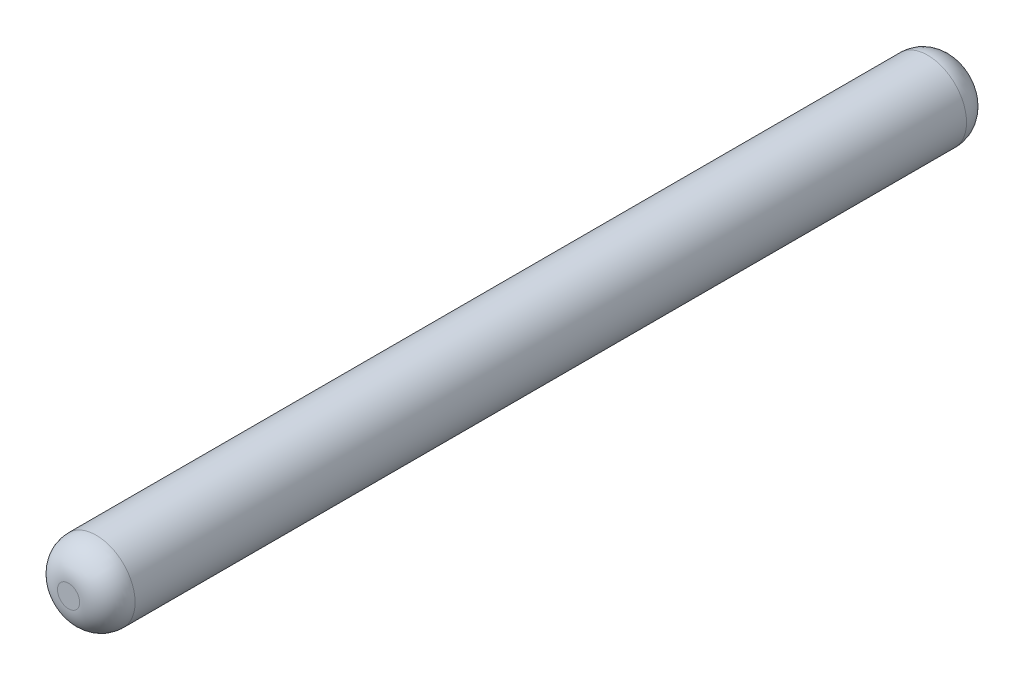
ISO-10303-21;
HEADER;
FILE_DESCRIPTION(('STEP AP214'),'2;1');
FILE_NAME('part.step','',(''),(''),'','','');
FILE_SCHEMA(('AUTOMOTIVE_DESIGN { 1 0 10303 214 1 1 1 1 }'));
ENDSEC;
DATA;
#1=APPLICATION_CONTEXT('core data for automotive mechanical design processes');
#2=APPLICATION_PROTOCOL_DEFINITION('international standard','automotive_design',2000,#1);
#3=PRODUCT_CONTEXT('',#1,'mechanical');
#4=PRODUCT('Part','Part','',(#3));
#5=PRODUCT_RELATED_PRODUCT_CATEGORY('part','',(#4));
#6=PRODUCT_DEFINITION_FORMATION('','',#4);
#7=PRODUCT_DEFINITION_CONTEXT('part definition',#1,'design');
#8=PRODUCT_DEFINITION('design','',#6,#7);
#9=PRODUCT_DEFINITION_SHAPE('','',#8);
#10=(LENGTH_UNIT() NAMED_UNIT(*) SI_UNIT(.MILLI.,.METRE.));
#11=(NAMED_UNIT(*) PLANE_ANGLE_UNIT() SI_UNIT($,.RADIAN.));
#12=(NAMED_UNIT(*) SI_UNIT($,.STERADIAN.) SOLID_ANGLE_UNIT());
#13=UNCERTAINTY_MEASURE_WITH_UNIT(LENGTH_MEASURE(1.E-05),#10,'distance_accuracy_value','');
#14=(GEOMETRIC_REPRESENTATION_CONTEXT(3) GLOBAL_UNCERTAINTY_ASSIGNED_CONTEXT((#13)) GLOBAL_UNIT_ASSIGNED_CONTEXT((#10,
#11,#12)) REPRESENTATION_CONTEXT('',''));
#15=CARTESIAN_POINT('',(0.,0.,0.));
#16=DIRECTION('',(0.,0.,1.));
#17=DIRECTION('',(1.,0.,0.));
#18=AXIS2_PLACEMENT_3D('',#15,#16,#17);
#19=CARTESIAN_POINT('',(0.,0.,12.));
#20=DIRECTION('',(0.,0.,-1.));
#21=DIRECTION('',(-1.,0.,0.));
#22=AXIS2_PLACEMENT_3D('',#19,#20,#21);
#23=CYLINDRICAL_SURFACE('',#22,0.525);
#24=CARTESIAN_POINT('',(0.,0.,0.375));
#25=DIRECTION('',(0.,0.,1.));
#26=DIRECTION('',(1.,0.,0.));
#27=AXIS2_PLACEMENT_3D('',#24,#25,#26);
#28=CIRCLE('',#27,0.525);
#29=CARTESIAN_POINT('',(0.525,0.,0.375));
#30=VERTEX_POINT('',#29);
#31=EDGE_CURVE('E46',#30,#30,#28,.T.);
#32=ORIENTED_EDGE('',*,*,#31,.T.);
#33=EDGE_LOOP('',(#32));
#34=FACE_BOUND('',#33,.T.);
#35=CARTESIAN_POINT('',(0.,0.,11.625));
#36=DIRECTION('',(0.,0.,1.));
#37=DIRECTION('',(1.,0.,0.));
#38=AXIS2_PLACEMENT_3D('',#35,#36,#37);
#39=CIRCLE('',#38,0.525);
#40=CARTESIAN_POINT('',(0.525,0.,11.625));
#41=VERTEX_POINT('',#40);
#42=EDGE_CURVE('E50',#41,#41,#39,.F.);
#43=ORIENTED_EDGE('',*,*,#42,.T.);
#44=EDGE_LOOP('',(#43));
#45=FACE_BOUND('',#44,.T.);
#46=ADVANCED_FACE('F35',(#34,#45),#23,.T.);
#47=CARTESIAN_POINT('',(0.,0.,12.));
#48=DIRECTION('',(0.,0.,1.));
#49=DIRECTION('',(1.,0.,0.));
#50=AXIS2_PLACEMENT_3D('',#47,#48,#49);
#51=PLANE('',#50);
#52=CARTESIAN_POINT('',(0.,0.,12.));
#53=DIRECTION('',(0.,0.,1.));
#54=DIRECTION('',(1.,0.,0.));
#55=AXIS2_PLACEMENT_3D('',#52,#53,#54);
#56=CIRCLE('',#55,0.15);
#57=CARTESIAN_POINT('',(0.15,0.,12.));
#58=VERTEX_POINT('',#57);
#59=EDGE_CURVE('E10',#58,#58,#56,.T.);
#60=ORIENTED_EDGE('',*,*,#59,.T.);
#61=EDGE_LOOP('',(#60));
#62=FACE_BOUND('',#61,.T.);
#63=ADVANCED_FACE('F66',(#62),#51,.T.);
#64=CARTESIAN_POINT('',(0.,0.,0.));
#65=DIRECTION('',(0.,0.,1.));
#66=DIRECTION('',(1.,0.,0.));
#67=AXIS2_PLACEMENT_3D('',#64,#65,#66);
#68=PLANE('',#67);
#69=CARTESIAN_POINT('',(0.,0.,0.));
#70=DIRECTION('',(0.,0.,1.));
#71=DIRECTION('',(1.,0.,0.));
#72=AXIS2_PLACEMENT_3D('',#69,#70,#71);
#73=CIRCLE('',#72,0.15);
#74=CARTESIAN_POINT('',(0.15,0.,0.));
#75=VERTEX_POINT('',#74);
#76=EDGE_CURVE('E42',#75,#75,#73,.F.);
#77=ORIENTED_EDGE('',*,*,#76,.T.);
#78=EDGE_LOOP('',(#77));
#79=FACE_BOUND('',#78,.T.);
#80=ADVANCED_FACE('F63',(#79),#68,.F.);
#81=CARTESIAN_POINT('',(0.,0.,0.375));
#82=DIRECTION('',(0.,0.,1.));
#83=DIRECTION('',(1.,0.,0.));
#84=AXIS2_PLACEMENT_3D('',#81,#82,#83);
#85=DEGENERATE_TOROIDAL_SURFACE('',#84,0.15,0.375,.T.);
#86=ORIENTED_EDGE('',*,*,#76,.F.);
#87=EDGE_LOOP('',(#86));
#88=FACE_BOUND('',#87,.T.);
#89=ORIENTED_EDGE('',*,*,#31,.F.);
#90=EDGE_LOOP('',(#89));
#91=FACE_BOUND('',#90,.T.);
#92=ADVANCED_FACE('F59',(#88,#91),#85,.T.);
#93=CARTESIAN_POINT('',(0.,0.,11.625));
#94=DIRECTION('',(0.,0.,1.));
#95=DIRECTION('',(1.,0.,0.));
#96=AXIS2_PLACEMENT_3D('',#93,#94,#95);
#97=DEGENERATE_TOROIDAL_SURFACE('',#96,0.15,0.375,.T.);
#98=ORIENTED_EDGE('',*,*,#42,.F.);
#99=EDGE_LOOP('',(#98));
#100=FACE_BOUND('',#99,.T.);
#101=ORIENTED_EDGE('',*,*,#59,.F.);
#102=EDGE_LOOP('',(#101));
#103=FACE_BOUND('',#102,.T.);
#104=ADVANCED_FACE('F37',(#100,#103),#97,.T.);
#105=CLOSED_SHELL('',(#46,#63,#80,#92,#104));
#106=MANIFOLD_SOLID_BREP('B2',#105);
#107=ADVANCED_BREP_SHAPE_REPRESENTATION('',(#18,#106),#14);
#108=SHAPE_DEFINITION_REPRESENTATION(#9,#107);
ENDSEC;
END-ISO-10303-21;
